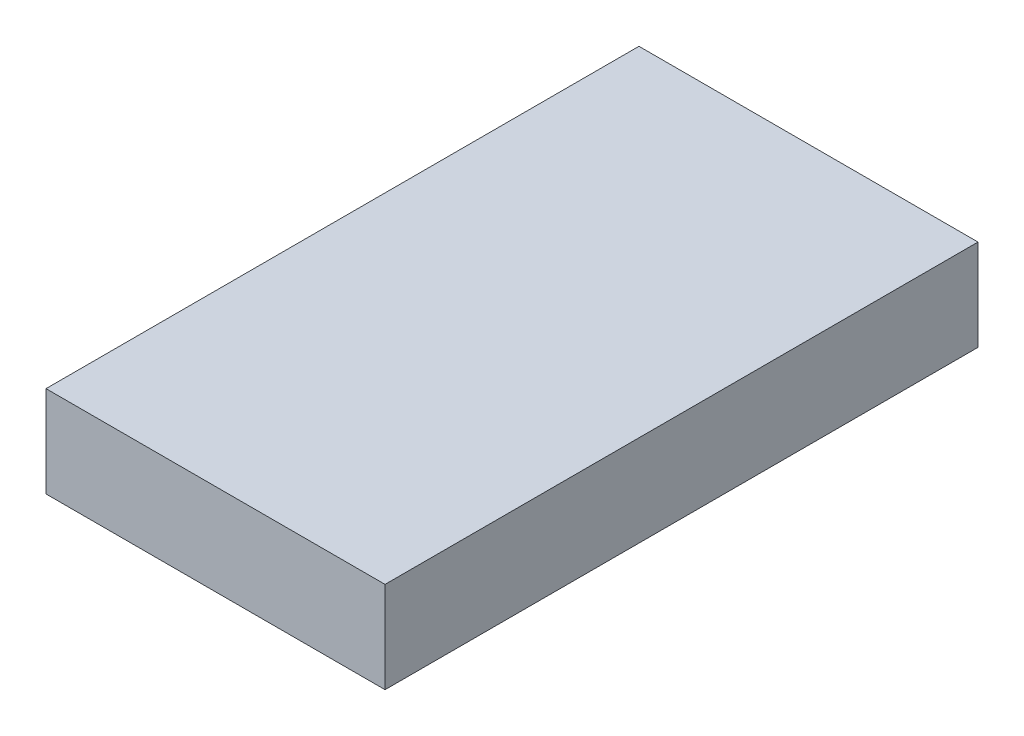
ISO-10303-21;
HEADER;
FILE_DESCRIPTION(('STEP AP214'),'2;1');
FILE_NAME('part.step','',(''),(''),'','','');
FILE_SCHEMA(('AUTOMOTIVE_DESIGN { 1 0 10303 214 1 1 1 1 }'));
ENDSEC;
DATA;
#1=APPLICATION_CONTEXT('core data for automotive mechanical design processes');
#2=APPLICATION_PROTOCOL_DEFINITION('international standard','automotive_design',2000,#1);
#3=PRODUCT_CONTEXT('',#1,'mechanical');
#4=PRODUCT('Part','Part','',(#3));
#5=PRODUCT_RELATED_PRODUCT_CATEGORY('part','',(#4));
#6=PRODUCT_DEFINITION_FORMATION('','',#4);
#7=PRODUCT_DEFINITION_CONTEXT('part definition',#1,'design');
#8=PRODUCT_DEFINITION('design','',#6,#7);
#9=PRODUCT_DEFINITION_SHAPE('','',#8);
#10=(LENGTH_UNIT() NAMED_UNIT(*) SI_UNIT(.MILLI.,.METRE.));
#11=(NAMED_UNIT(*) PLANE_ANGLE_UNIT() SI_UNIT($,.RADIAN.));
#12=(NAMED_UNIT(*) SI_UNIT($,.STERADIAN.) SOLID_ANGLE_UNIT());
#13=UNCERTAINTY_MEASURE_WITH_UNIT(LENGTH_MEASURE(1.E-05),#10,'distance_accuracy_value','');
#14=(GEOMETRIC_REPRESENTATION_CONTEXT(3) GLOBAL_UNCERTAINTY_ASSIGNED_CONTEXT((#13)) GLOBAL_UNIT_ASSIGNED_CONTEXT((#10,
#11,#12)) REPRESENTATION_CONTEXT('',''));
#15=CARTESIAN_POINT('',(0.,0.,0.));
#16=DIRECTION('',(0.,0.,1.));
#17=DIRECTION('',(1.,0.,0.));
#18=AXIS2_PLACEMENT_3D('',#15,#16,#17);
#19=CARTESIAN_POINT('',(0.,6.,0.));
#20=DIRECTION('',(0.,0.,1.));
#21=DIRECTION('',(1.,0.,0.));
#22=AXIS2_PLACEMENT_3D('',#19,#20,#21);
#23=PLANE('',#22);
#24=DIRECTION('',(-1.,0.,0.));
#25=VECTOR('',#24,1.);
#26=CARTESIAN_POINT('',(0.,0.,0.));
#27=LINE('',#26,#25);
#28=CARTESIAN_POINT('',(22.3,0.,0.));
#29=VERTEX_POINT('',#28);
#30=CARTESIAN_POINT('',(0.,0.,0.));
#31=VERTEX_POINT('',#30);
#32=EDGE_CURVE('E107',#29,#31,#27,.T.);
#33=ORIENTED_EDGE('',*,*,#32,.T.);
#34=DIRECTION('',(0.,-1.,0.));
#35=VECTOR('',#34,1.);
#36=CARTESIAN_POINT('',(0.,6.,0.));
#37=LINE('',#36,#35);
#38=CARTESIAN_POINT('',(0.,6.,0.));
#39=VERTEX_POINT('',#38);
#40=EDGE_CURVE('E11',#39,#31,#37,.T.);
#41=ORIENTED_EDGE('',*,*,#40,.F.);
#42=DIRECTION('',(-1.,0.,0.));
#43=VECTOR('',#42,1.);
#44=CARTESIAN_POINT('',(0.,6.,0.));
#45=LINE('',#44,#43);
#46=CARTESIAN_POINT('',(22.3,6.,0.));
#47=VERTEX_POINT('',#46);
#48=EDGE_CURVE('E91',#47,#39,#45,.T.);
#49=ORIENTED_EDGE('',*,*,#48,.F.);
#50=DIRECTION('',(0.,-1.,0.));
#51=VECTOR('',#50,1.);
#52=CARTESIAN_POINT('',(22.3,6.,0.));
#53=LINE('',#52,#51);
#54=EDGE_CURVE('E103',#47,#29,#53,.T.);
#55=ORIENTED_EDGE('',*,*,#54,.T.);
#56=EDGE_LOOP('',(#33,#41,#49,#55));
#57=FACE_BOUND('',#56,.T.);
#58=ADVANCED_FACE('F39',(#57),#23,.F.);
#59=CARTESIAN_POINT('',(0.,6.,0.));
#60=DIRECTION('',(1.,0.,0.));
#61=DIRECTION('',(0.,0.,-1.));
#62=AXIS2_PLACEMENT_3D('',#59,#60,#61);
#63=PLANE('',#62);
#64=DIRECTION('',(0.,0.,1.));
#65=VECTOR('',#64,1.);
#66=CARTESIAN_POINT('',(0.,0.,0.));
#67=LINE('',#66,#65);
#68=CARTESIAN_POINT('',(0.,0.,39.));
#69=VERTEX_POINT('',#68);
#70=EDGE_CURVE('E96',#31,#69,#67,.T.);
#71=ORIENTED_EDGE('',*,*,#70,.T.);
#72=DIRECTION('',(0.,-1.,0.));
#73=VECTOR('',#72,1.);
#74=CARTESIAN_POINT('',(0.,6.,39.));
#75=LINE('',#74,#73);
#76=CARTESIAN_POINT('',(0.,6.,39.));
#77=VERTEX_POINT('',#76);
#78=EDGE_CURVE('E48',#77,#69,#75,.T.);
#79=ORIENTED_EDGE('',*,*,#78,.F.);
#80=DIRECTION('',(0.,0.,1.));
#81=VECTOR('',#80,1.);
#82=CARTESIAN_POINT('',(0.,6.,0.));
#83=LINE('',#82,#81);
#84=EDGE_CURVE('E86',#39,#77,#83,.T.);
#85=ORIENTED_EDGE('',*,*,#84,.F.);
#86=ORIENTED_EDGE('',*,*,#40,.T.);
#87=EDGE_LOOP('',(#71,#79,#85,#86));
#88=FACE_BOUND('',#87,.T.);
#89=ADVANCED_FACE('F95',(#88),#63,.F.);
#90=CARTESIAN_POINT('',(22.3,6.,39.));
#91=DIRECTION('',(0.,0.,-1.));
#92=DIRECTION('',(-1.,0.,0.));
#93=AXIS2_PLACEMENT_3D('',#90,#91,#92);
#94=PLANE('',#93);
#95=DIRECTION('',(1.,0.,0.));
#96=VECTOR('',#95,1.);
#97=CARTESIAN_POINT('',(22.3,0.,39.));
#98=LINE('',#97,#96);
#99=CARTESIAN_POINT('',(22.3,0.,39.));
#100=VERTEX_POINT('',#99);
#101=EDGE_CURVE('E73',#69,#100,#98,.T.);
#102=ORIENTED_EDGE('',*,*,#101,.T.);
#103=DIRECTION('',(0.,-1.,0.));
#104=VECTOR('',#103,1.);
#105=CARTESIAN_POINT('',(22.3,6.,39.));
#106=LINE('',#105,#104);
#107=CARTESIAN_POINT('',(22.3,6.,39.));
#108=VERTEX_POINT('',#107);
#109=EDGE_CURVE('E98',#108,#100,#106,.T.);
#110=ORIENTED_EDGE('',*,*,#109,.F.);
#111=DIRECTION('',(1.,0.,0.));
#112=VECTOR('',#111,1.);
#113=CARTESIAN_POINT('',(22.3,6.,39.));
#114=LINE('',#113,#112);
#115=EDGE_CURVE('E89',#77,#108,#114,.T.);
#116=ORIENTED_EDGE('',*,*,#115,.F.);
#117=ORIENTED_EDGE('',*,*,#78,.T.);
#118=EDGE_LOOP('',(#102,#110,#116,#117));
#119=FACE_BOUND('',#118,.T.);
#120=ADVANCED_FACE('F99',(#119),#94,.F.);
#121=CARTESIAN_POINT('',(22.3,6.,0.));
#122=DIRECTION('',(-1.,0.,0.));
#123=DIRECTION('',(0.,0.,1.));
#124=AXIS2_PLACEMENT_3D('',#121,#122,#123);
#125=PLANE('',#124);
#126=DIRECTION('',(0.,0.,-1.));
#127=VECTOR('',#126,1.);
#128=CARTESIAN_POINT('',(22.3,0.,0.));
#129=LINE('',#128,#127);
#130=EDGE_CURVE('E79',#100,#29,#129,.T.);
#131=ORIENTED_EDGE('',*,*,#130,.T.);
#132=ORIENTED_EDGE('',*,*,#54,.F.);
#133=DIRECTION('',(0.,0.,-1.));
#134=VECTOR('',#133,1.);
#135=CARTESIAN_POINT('',(22.3,6.,0.));
#136=LINE('',#135,#134);
#137=EDGE_CURVE('E56',#108,#47,#136,.T.);
#138=ORIENTED_EDGE('',*,*,#137,.F.);
#139=ORIENTED_EDGE('',*,*,#109,.T.);
#140=EDGE_LOOP('',(#131,#132,#138,#139));
#141=FACE_BOUND('',#140,.T.);
#142=ADVANCED_FACE('F120',(#141),#125,.F.);
#143=CARTESIAN_POINT('',(0.,6.,0.));
#144=DIRECTION('',(0.,-1.,0.));
#145=DIRECTION('',(0.,0.,-1.));
#146=AXIS2_PLACEMENT_3D('',#143,#144,#145);
#147=PLANE('',#146);
#148=ORIENTED_EDGE('',*,*,#48,.T.);
#149=ORIENTED_EDGE('',*,*,#84,.T.);
#150=ORIENTED_EDGE('',*,*,#115,.T.);
#151=ORIENTED_EDGE('',*,*,#137,.T.);
#152=EDGE_LOOP('',(#148,#149,#150,#151));
#153=FACE_BOUND('',#152,.T.);
#154=ADVANCED_FACE('F87',(#153),#147,.F.);
#155=CARTESIAN_POINT('',(0.,0.,0.));
#156=DIRECTION('',(0.,-1.,0.));
#157=DIRECTION('',(0.,0.,-1.));
#158=AXIS2_PLACEMENT_3D('',#155,#156,#157);
#159=PLANE('',#158);
#160=ORIENTED_EDGE('',*,*,#32,.F.);
#161=ORIENTED_EDGE('',*,*,#130,.F.);
#162=ORIENTED_EDGE('',*,*,#101,.F.);
#163=ORIENTED_EDGE('',*,*,#70,.F.);
#164=EDGE_LOOP('',(#160,#161,#162,#163));
#165=FACE_BOUND('',#164,.T.);
#166=ADVANCED_FACE('F123',(#165),#159,.T.);
#167=CLOSED_SHELL('',(#58,#89,#120,#142,#154,#166));
#168=MANIFOLD_SOLID_BREP('B2',#167);
#169=ADVANCED_BREP_SHAPE_REPRESENTATION('',(#18,#168),#14);
#170=SHAPE_DEFINITION_REPRESENTATION(#9,#169);
ENDSEC;
END-ISO-10303-21;
